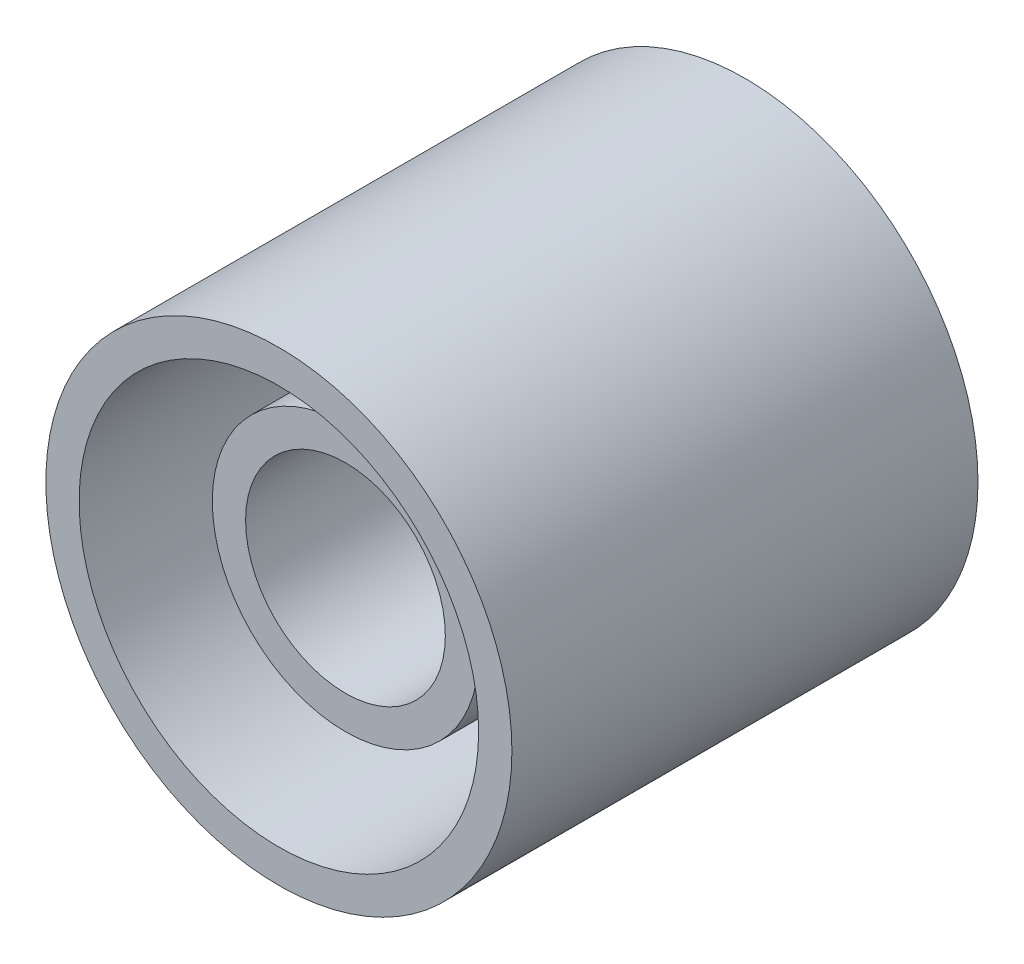
ISO-10303-21;
HEADER;
FILE_DESCRIPTION(('STEP AP214'),'2;1');
FILE_NAME('part.step','',(''),(''),'','','');
FILE_SCHEMA(('AUTOMOTIVE_DESIGN { 1 0 10303 214 1 1 1 1 }'));
ENDSEC;
DATA;
#1=APPLICATION_CONTEXT('core data for automotive mechanical design processes');
#2=APPLICATION_PROTOCOL_DEFINITION('international standard','automotive_design',2000,#1);
#3=PRODUCT_CONTEXT('',#1,'mechanical');
#4=PRODUCT('Part','Part','',(#3));
#5=PRODUCT_RELATED_PRODUCT_CATEGORY('part','',(#4));
#6=PRODUCT_DEFINITION_FORMATION('','',#4);
#7=PRODUCT_DEFINITION_CONTEXT('part definition',#1,'design');
#8=PRODUCT_DEFINITION('design','',#6,#7);
#9=PRODUCT_DEFINITION_SHAPE('','',#8);
#10=(LENGTH_UNIT() NAMED_UNIT(*) SI_UNIT(.MILLI.,.METRE.));
#11=(NAMED_UNIT(*) PLANE_ANGLE_UNIT() SI_UNIT($,.RADIAN.));
#12=(NAMED_UNIT(*) SI_UNIT($,.STERADIAN.) SOLID_ANGLE_UNIT());
#13=UNCERTAINTY_MEASURE_WITH_UNIT(LENGTH_MEASURE(1.E-05),#10,'distance_accuracy_value','');
#14=(GEOMETRIC_REPRESENTATION_CONTEXT(3) GLOBAL_UNCERTAINTY_ASSIGNED_CONTEXT((#13)) GLOBAL_UNIT_ASSIGNED_CONTEXT((#10,
#11,#12)) REPRESENTATION_CONTEXT('',''));
#15=CARTESIAN_POINT('',(0.,0.,0.));
#16=DIRECTION('',(0.,0.,1.));
#17=DIRECTION('',(1.,0.,0.));
#18=AXIS2_PLACEMENT_3D('',#15,#16,#17);
#19=CARTESIAN_POINT('',(0.,0.,0.5));
#20=DIRECTION('',(0.,0.,1.));
#21=DIRECTION('',(1.,0.,0.));
#22=AXIS2_PLACEMENT_3D('',#19,#20,#21);
#23=CYLINDRICAL_SURFACE('',#22,1.);
#24=CARTESIAN_POINT('',(0.,0.,0.5));
#25=DIRECTION('',(0.,0.,1.));
#26=DIRECTION('',(1.,0.,0.));
#27=AXIS2_PLACEMENT_3D('',#24,#25,#26);
#28=CIRCLE('',#27,1.);
#29=CARTESIAN_POINT('',(1.,0.,0.5));
#30=VERTEX_POINT('',#29);
#31=EDGE_CURVE('E56',#30,#30,#28,.T.);
#32=ORIENTED_EDGE('',*,*,#31,.T.);
#33=EDGE_LOOP('',(#32));
#34=FACE_BOUND('',#33,.T.);
#35=CARTESIAN_POINT('',(0.,0.,3.));
#36=DIRECTION('',(0.,0.,1.));
#37=DIRECTION('',(1.,0.,0.));
#38=AXIS2_PLACEMENT_3D('',#35,#36,#37);
#39=CIRCLE('',#38,1.);
#40=CARTESIAN_POINT('',(1.,0.,3.));
#41=VERTEX_POINT('',#40);
#42=EDGE_CURVE('E61',#41,#41,#39,.T.);
#43=ORIENTED_EDGE('',*,*,#42,.F.);
#44=EDGE_LOOP('',(#43));
#45=FACE_BOUND('',#44,.T.);
#46=ADVANCED_FACE('F35',(#34,#45),#23,.T.);
#47=CARTESIAN_POINT('',(0.,0.,3.5));
#48=DIRECTION('',(0.,0.,-1.));
#49=DIRECTION('',(-1.,0.,0.));
#50=AXIS2_PLACEMENT_3D('',#47,#48,#49);
#51=CYLINDRICAL_SURFACE('',#50,1.75);
#52=CARTESIAN_POINT('',(0.,0.,3.5));
#53=DIRECTION('',(0.,0.,1.));
#54=DIRECTION('',(1.,0.,0.));
#55=AXIS2_PLACEMENT_3D('',#52,#53,#54);
#56=CIRCLE('',#55,1.75);
#57=CARTESIAN_POINT('',(1.75,0.,3.5));
#58=VERTEX_POINT('',#57);
#59=EDGE_CURVE('E10',#58,#58,#56,.T.);
#60=ORIENTED_EDGE('',*,*,#59,.F.);
#61=EDGE_LOOP('',(#60));
#62=FACE_BOUND('',#61,.T.);
#63=CARTESIAN_POINT('',(0.,0.,0.));
#64=DIRECTION('',(0.,0.,1.));
#65=DIRECTION('',(1.,0.,0.));
#66=AXIS2_PLACEMENT_3D('',#63,#64,#65);
#67=CIRCLE('',#66,1.75);
#68=CARTESIAN_POINT('',(1.75,0.,0.));
#69=VERTEX_POINT('',#68);
#70=EDGE_CURVE('E43',#69,#69,#67,.T.);
#71=ORIENTED_EDGE('',*,*,#70,.T.);
#72=EDGE_LOOP('',(#71));
#73=FACE_BOUND('',#72,.T.);
#74=ADVANCED_FACE('F37',(#62,#73),#51,.T.);
#75=CARTESIAN_POINT('',(0.,0.,3.5));
#76=DIRECTION('',(0.,0.,1.));
#77=DIRECTION('',(1.,0.,0.));
#78=AXIS2_PLACEMENT_3D('',#75,#76,#77);
#79=PLANE('',#78);
#80=CARTESIAN_POINT('',(0.,0.,3.5));
#81=DIRECTION('',(0.,0.,1.));
#82=DIRECTION('',(1.,0.,0.));
#83=AXIS2_PLACEMENT_3D('',#80,#81,#82);
#84=CIRCLE('',#83,1.5);
#85=CARTESIAN_POINT('',(1.5,0.,3.5));
#86=VERTEX_POINT('',#85);
#87=EDGE_CURVE('E53',#86,#86,#84,.T.);
#88=ORIENTED_EDGE('',*,*,#87,.F.);
#89=EDGE_LOOP('',(#88));
#90=FACE_BOUND('',#89,.T.);
#91=ORIENTED_EDGE('',*,*,#59,.T.);
#92=EDGE_LOOP('',(#91));
#93=FACE_BOUND('',#92,.T.);
#94=ADVANCED_FACE('F84',(#90,#93),#79,.T.);
#95=CARTESIAN_POINT('',(0.,0.,0.));
#96=DIRECTION('',(0.,0.,1.));
#97=DIRECTION('',(1.,0.,0.));
#98=AXIS2_PLACEMENT_3D('',#95,#96,#97);
#99=PLANE('',#98);
#100=CARTESIAN_POINT('',(0.,0.,0.));
#101=DIRECTION('',(0.,0.,-1.));
#102=DIRECTION('',(-1.,0.,0.));
#103=AXIS2_PLACEMENT_3D('',#100,#101,#102);
#104=CIRCLE('',#103,1.5);
#105=CARTESIAN_POINT('',(-1.5,0.,0.));
#106=VERTEX_POINT('',#105);
#107=EDGE_CURVE('E65',#106,#106,#104,.T.);
#108=ORIENTED_EDGE('',*,*,#107,.F.);
#109=EDGE_LOOP('',(#108));
#110=FACE_BOUND('',#109,.T.);
#111=ORIENTED_EDGE('',*,*,#70,.F.);
#112=EDGE_LOOP('',(#111));
#113=FACE_BOUND('',#112,.T.);
#114=ADVANCED_FACE('F80',(#110,#113),#99,.F.);
#115=CARTESIAN_POINT('',(0.,0.,0.5));
#116=DIRECTION('',(0.,0.,1.));
#117=DIRECTION('',(1.,0.,0.));
#118=AXIS2_PLACEMENT_3D('',#115,#116,#117);
#119=CYLINDRICAL_SURFACE('',#118,1.5);
#120=CARTESIAN_POINT('',(0.,0.,0.5));
#121=DIRECTION('',(0.,0.,1.));
#122=DIRECTION('',(1.,0.,0.));
#123=AXIS2_PLACEMENT_3D('',#120,#121,#122);
#124=CIRCLE('',#123,1.5);
#125=CARTESIAN_POINT('',(1.5,0.,0.5));
#126=VERTEX_POINT('',#125);
#127=EDGE_CURVE('E52',#126,#126,#124,.T.);
#128=ORIENTED_EDGE('',*,*,#127,.F.);
#129=EDGE_LOOP('',(#128));
#130=FACE_BOUND('',#129,.T.);
#131=ORIENTED_EDGE('',*,*,#87,.T.);
#132=EDGE_LOOP('',(#131));
#133=FACE_BOUND('',#132,.T.);
#134=ADVANCED_FACE('F83',(#130,#133),#119,.F.);
#135=CARTESIAN_POINT('',(0.,0.,0.5));
#136=DIRECTION('',(0.,0.,1.));
#137=DIRECTION('',(1.,0.,0.));
#138=AXIS2_PLACEMENT_3D('',#135,#136,#137);
#139=PLANE('',#138);
#140=ORIENTED_EDGE('',*,*,#31,.F.);
#141=EDGE_LOOP('',(#140));
#142=FACE_BOUND('',#141,.T.);
#143=ORIENTED_EDGE('',*,*,#127,.T.);
#144=EDGE_LOOP('',(#143));
#145=FACE_BOUND('',#144,.T.);
#146=ADVANCED_FACE('F103',(#142,#145),#139,.T.);
#147=CARTESIAN_POINT('',(0.,0.,3.));
#148=DIRECTION('',(0.,0.,1.));
#149=DIRECTION('',(1.,0.,0.));
#150=AXIS2_PLACEMENT_3D('',#147,#148,#149);
#151=PLANE('',#150);
#152=ORIENTED_EDGE('',*,*,#42,.T.);
#153=EDGE_LOOP('',(#152));
#154=FACE_BOUND('',#153,.T.);
#155=CARTESIAN_POINT('',(0.,0.,3.));
#156=DIRECTION('',(0.,0.,1.));
#157=DIRECTION('',(1.,0.,0.));
#158=AXIS2_PLACEMENT_3D('',#155,#156,#157);
#159=CIRCLE('',#158,0.75);
#160=CARTESIAN_POINT('',(0.75,0.,3.));
#161=VERTEX_POINT('',#160);
#162=EDGE_CURVE('E39',#161,#161,#159,.F.);
#163=ORIENTED_EDGE('',*,*,#162,.T.);
#164=EDGE_LOOP('',(#163));
#165=FACE_BOUND('',#164,.T.);
#166=ADVANCED_FACE('F102',(#154,#165),#151,.T.);
#167=CARTESIAN_POINT('',(0.,0.,0.5));
#168=DIRECTION('',(0.,0.,1.));
#169=DIRECTION('',(1.,0.,0.));
#170=AXIS2_PLACEMENT_3D('',#167,#168,#169);
#171=PLANE('',#170);
#172=CARTESIAN_POINT('',(0.,0.,0.5));
#173=DIRECTION('',(0.,0.,1.));
#174=DIRECTION('',(1.,0.,0.));
#175=AXIS2_PLACEMENT_3D('',#172,#173,#174);
#176=CIRCLE('',#175,0.75);
#177=CARTESIAN_POINT('',(0.75,0.,0.5));
#178=VERTEX_POINT('',#177);
#179=EDGE_CURVE('E48',#178,#178,#176,.T.);
#180=ORIENTED_EDGE('',*,*,#179,.T.);
#181=EDGE_LOOP('',(#180));
#182=FACE_BOUND('',#181,.T.);
#183=ADVANCED_FACE('F110',(#182),#171,.T.);
#184=CARTESIAN_POINT('',(0.,0.,0.5));
#185=DIRECTION('',(0.,0.,1.));
#186=DIRECTION('',(1.,0.,0.));
#187=AXIS2_PLACEMENT_3D('',#184,#185,#186);
#188=CYLINDRICAL_SURFACE('',#187,0.75);
#189=ORIENTED_EDGE('',*,*,#179,.F.);
#190=EDGE_LOOP('',(#189));
#191=FACE_BOUND('',#190,.T.);
#192=ORIENTED_EDGE('',*,*,#162,.F.);
#193=EDGE_LOOP('',(#192));
#194=FACE_BOUND('',#193,.T.);
#195=ADVANCED_FACE('F76',(#191,#194),#188,.F.);
#196=CARTESIAN_POINT('',(0.,0.,0.3));
#197=DIRECTION('',(0.,0.,-1.));
#198=DIRECTION('',(-1.,0.,0.));
#199=AXIS2_PLACEMENT_3D('',#196,#197,#198);
#200=CYLINDRICAL_SURFACE('',#199,1.5);
#201=CARTESIAN_POINT('',(0.,0.,0.3));
#202=DIRECTION('',(0.,0.,-1.));
#203=DIRECTION('',(-1.,0.,0.));
#204=AXIS2_PLACEMENT_3D('',#201,#202,#203);
#205=CIRCLE('',#204,1.5);
#206=CARTESIAN_POINT('',(-1.5,0.,0.3));
#207=VERTEX_POINT('',#206);
#208=EDGE_CURVE('E64',#207,#207,#205,.T.);
#209=ORIENTED_EDGE('',*,*,#208,.F.);
#210=EDGE_LOOP('',(#209));
#211=FACE_BOUND('',#210,.T.);
#212=ORIENTED_EDGE('',*,*,#107,.T.);
#213=EDGE_LOOP('',(#212));
#214=FACE_BOUND('',#213,.T.);
#215=ADVANCED_FACE('F73',(#211,#214),#200,.F.);
#216=CARTESIAN_POINT('',(0.,0.,0.3));
#217=DIRECTION('',(0.,0.,-1.));
#218=DIRECTION('',(-1.,0.,0.));
#219=AXIS2_PLACEMENT_3D('',#216,#217,#218);
#220=PLANE('',#219);
#221=ORIENTED_EDGE('',*,*,#208,.T.);
#222=EDGE_LOOP('',(#221));
#223=FACE_BOUND('',#222,.T.);
#224=ADVANCED_FACE('F71',(#223),#220,.T.);
#225=CLOSED_SHELL('',(#46,#74,#94,#114,#134,#146,#166,#183,#195,#215,#224));
#226=MANIFOLD_SOLID_BREP('B2',#225);
#227=ADVANCED_BREP_SHAPE_REPRESENTATION('',(#18,#226),#14);
#228=SHAPE_DEFINITION_REPRESENTATION(#9,#227);
ENDSEC;
END-ISO-10303-21;
